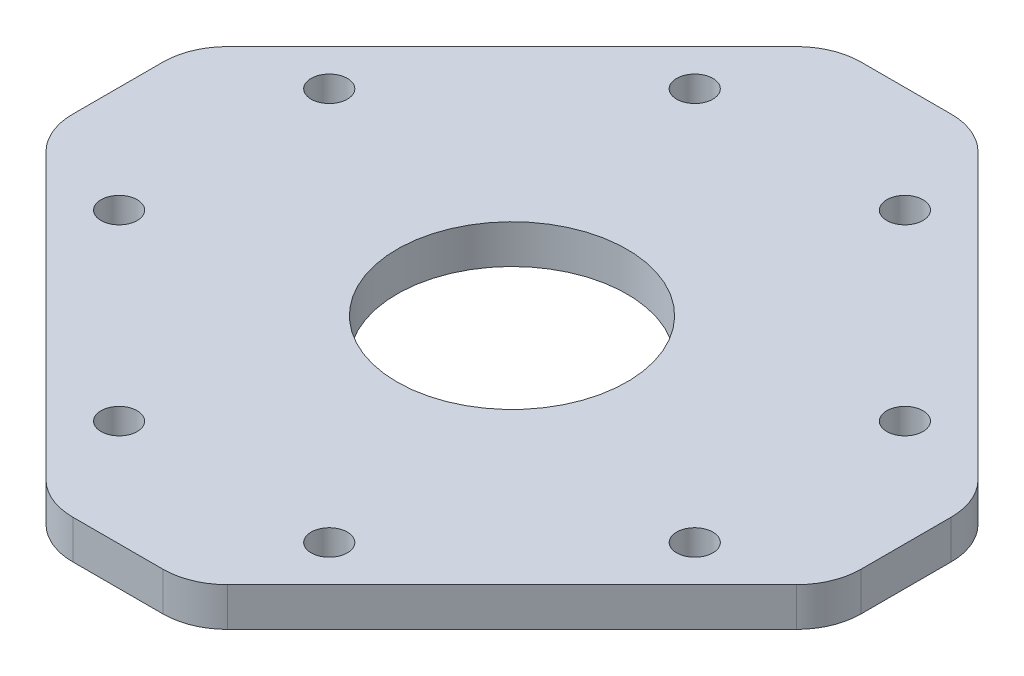
ISO-10303-21;
HEADER;
FILE_DESCRIPTION(('STEP AP214'),'2;1');
FILE_NAME('part.step','',(''),(''),'','','');
FILE_SCHEMA(('AUTOMOTIVE_DESIGN { 1 0 10303 214 1 1 1 1 }'));
ENDSEC;
DATA;
#1=APPLICATION_CONTEXT('core data for automotive mechanical design processes');
#2=APPLICATION_PROTOCOL_DEFINITION('international standard','automotive_design',2000,#1);
#3=PRODUCT_CONTEXT('',#1,'mechanical');
#4=PRODUCT('Part','Part','',(#3));
#5=PRODUCT_RELATED_PRODUCT_CATEGORY('part','',(#4));
#6=PRODUCT_DEFINITION_FORMATION('','',#4);
#7=PRODUCT_DEFINITION_CONTEXT('part definition',#1,'design');
#8=PRODUCT_DEFINITION('design','',#6,#7);
#9=PRODUCT_DEFINITION_SHAPE('','',#8);
#10=(LENGTH_UNIT() NAMED_UNIT(*) SI_UNIT(.MILLI.,.METRE.));
#11=(NAMED_UNIT(*) PLANE_ANGLE_UNIT() SI_UNIT($,.RADIAN.));
#12=(NAMED_UNIT(*) SI_UNIT($,.STERADIAN.) SOLID_ANGLE_UNIT());
#13=UNCERTAINTY_MEASURE_WITH_UNIT(LENGTH_MEASURE(1.E-05),#10,'distance_accuracy_value','');
#14=(GEOMETRIC_REPRESENTATION_CONTEXT(3) GLOBAL_UNCERTAINTY_ASSIGNED_CONTEXT((#13)) GLOBAL_UNIT_ASSIGNED_CONTEXT((#10,
#11,#12)) REPRESENTATION_CONTEXT('',''));
#15=CARTESIAN_POINT('',(0.,0.,0.));
#16=DIRECTION('',(0.,0.,1.));
#17=DIRECTION('',(1.,0.,0.));
#18=AXIS2_PLACEMENT_3D('',#15,#16,#17);
#19=CARTESIAN_POINT('',(3.49137802864851,3.,-25.5));
#20=DIRECTION('',(0.,1.,0.));
#21=DIRECTION('',(0.,0.,1.));
#22=AXIS2_PLACEMENT_3D('',#19,#20,#21);
#23=PLANE('',#22);
#24=CARTESIAN_POINT('',(-8.1317279836453,3.,-22.2738636073762));
#25=DIRECTION('',(0.,1.,0.));
#26=DIRECTION('',(0.,0.,1.));
#27=AXIS2_PLACEMENT_3D('',#24,#25,#26);
#28=CIRCLE('',#27,1.4);
#29=CARTESIAN_POINT('',(-8.1317279836453,3.,-20.8738636073762));
#30=VERTEX_POINT('',#29);
#31=EDGE_CURVE('E371',#30,#30,#28,.T.);
#32=ORIENTED_EDGE('',*,*,#31,.F.);
#33=EDGE_LOOP('',(#32));
#34=FACE_BOUND('',#33,.T.);
#35=CARTESIAN_POINT('',(22.2738636073762,3.,-8.1317279836453));
#36=DIRECTION('',(0.,1.,0.));
#37=DIRECTION('',(0.,0.,1.));
#38=AXIS2_PLACEMENT_3D('',#35,#36,#37);
#39=CIRCLE('',#38,1.4);
#40=CARTESIAN_POINT('',(22.2738636073762,3.,-6.7317279836453));
#41=VERTEX_POINT('',#40);
#42=EDGE_CURVE('E355',#41,#41,#39,.T.);
#43=ORIENTED_EDGE('',*,*,#42,.F.);
#44=EDGE_LOOP('',(#43));
#45=FACE_BOUND('',#44,.T.);
#46=CARTESIAN_POINT('',(-22.2738636073762,3.,8.1317279836453));
#47=DIRECTION('',(0.,1.,0.));
#48=DIRECTION('',(0.,0.,1.));
#49=AXIS2_PLACEMENT_3D('',#46,#47,#48);
#50=CIRCLE('',#49,1.4);
#51=CARTESIAN_POINT('',(-22.2738636073762,3.,9.5317279836453));
#52=VERTEX_POINT('',#51);
#53=EDGE_CURVE('E339',#52,#52,#50,.T.);
#54=ORIENTED_EDGE('',*,*,#53,.F.);
#55=EDGE_LOOP('',(#54));
#56=FACE_BOUND('',#55,.T.);
#57=CARTESIAN_POINT('',(8.13172798364529,3.,22.2738636073762));
#58=DIRECTION('',(0.,1.,0.));
#59=DIRECTION('',(0.,0.,1.));
#60=AXIS2_PLACEMENT_3D('',#57,#58,#59);
#61=CIRCLE('',#60,1.4);
#62=CARTESIAN_POINT('',(8.13172798364529,3.,23.6738636073762));
#63=VERTEX_POINT('',#62);
#64=EDGE_CURVE('E221',#63,#63,#61,.T.);
#65=ORIENTED_EDGE('',*,*,#64,.F.);
#66=EDGE_LOOP('',(#65));
#67=FACE_BOUND('',#66,.T.);
#68=CARTESIAN_POINT('',(3.49137802864851,3.,-25.5));
#69=DIRECTION('',(0.,1.,0.));
#70=DIRECTION('',(0.,0.,1.));
#71=AXIS2_PLACEMENT_3D('',#68,#69,#70);
#72=CIRCLE('',#71,4.99999999999999);
#73=CARTESIAN_POINT('',(7.02691193458125,3.,-29.0355339059327));
#74=VERTEX_POINT('',#73);
#75=CARTESIAN_POINT('',(3.49137802864851,3.,-30.5));
#76=VERTEX_POINT('',#75);
#77=EDGE_CURVE('E222',#74,#76,#72,.T.);
#78=ORIENTED_EDGE('',*,*,#77,.T.);
#79=DIRECTION('',(-1.,0.,0.));
#80=VECTOR('',#79,1.);
#81=CARTESIAN_POINT('',(3.49137802864851,3.,-30.5));
#82=LINE('',#81,#80);
#83=CARTESIAN_POINT('',(-3.4913780286485,3.,-30.5));
#84=VERTEX_POINT('',#83);
#85=EDGE_CURVE('E131',#76,#84,#82,.T.);
#86=ORIENTED_EDGE('',*,*,#85,.T.);
#87=CARTESIAN_POINT('',(-3.4913780286485,3.,-25.5));
#88=DIRECTION('',(0.,1.,0.));
#89=DIRECTION('',(0.,0.,1.));
#90=AXIS2_PLACEMENT_3D('',#87,#88,#89);
#91=CIRCLE('',#90,4.99999999999999);
#92=CARTESIAN_POINT('',(-7.02691193458124,3.,-29.0355339059327));
#93=VERTEX_POINT('',#92);
#94=EDGE_CURVE('E236',#84,#93,#91,.T.);
#95=ORIENTED_EDGE('',*,*,#94,.T.);
#96=DIRECTION('',(-0.707106781186547,0.,0.707106781186548));
#97=VECTOR('',#96,1.);
#98=CARTESIAN_POINT('',(-7.02691193458124,3.,-29.0355339059327));
#99=LINE('',#98,#97);
#100=CARTESIAN_POINT('',(-29.0355339059327,3.,-7.02691193458124));
#101=VERTEX_POINT('',#100);
#102=EDGE_CURVE('E239',#93,#101,#99,.T.);
#103=ORIENTED_EDGE('',*,*,#102,.T.);
#104=CARTESIAN_POINT('',(-25.5,3.,-3.4913780286485));
#105=DIRECTION('',(0.,1.,0.));
#106=DIRECTION('',(0.,0.,1.));
#107=AXIS2_PLACEMENT_3D('',#104,#105,#106);
#108=CIRCLE('',#107,4.99999999999999);
#109=CARTESIAN_POINT('',(-30.5,3.,-3.4913780286485));
#110=VERTEX_POINT('',#109);
#111=EDGE_CURVE('E243',#101,#110,#108,.T.);
#112=ORIENTED_EDGE('',*,*,#111,.T.);
#113=DIRECTION('',(0.,0.,1.));
#114=VECTOR('',#113,1.);
#115=CARTESIAN_POINT('',(-30.5,3.,-3.4913780286485));
#116=LINE('',#115,#114);
#117=CARTESIAN_POINT('',(-30.5,3.,3.4913780286485));
#118=VERTEX_POINT('',#117);
#119=EDGE_CURVE('E247',#110,#118,#116,.T.);
#120=ORIENTED_EDGE('',*,*,#119,.T.);
#121=CARTESIAN_POINT('',(-25.5,3.,3.4913780286485));
#122=DIRECTION('',(0.,1.,0.));
#123=DIRECTION('',(0.,0.,1.));
#124=AXIS2_PLACEMENT_3D('',#121,#122,#123);
#125=CIRCLE('',#124,4.99999999999999);
#126=CARTESIAN_POINT('',(-29.0355339059327,3.,7.02691193458123));
#127=VERTEX_POINT('',#126);
#128=EDGE_CURVE('E255',#118,#127,#125,.T.);
#129=ORIENTED_EDGE('',*,*,#128,.T.);
#130=DIRECTION('',(0.707106781186547,0.,0.707106781186548));
#131=VECTOR('',#130,1.);
#132=CARTESIAN_POINT('',(-29.0355339059327,3.,7.02691193458123));
#133=LINE('',#132,#131);
#134=CARTESIAN_POINT('',(-7.02691193458126,3.,29.0355339059327));
#135=VERTEX_POINT('',#134);
#136=EDGE_CURVE('E258',#127,#135,#133,.T.);
#137=ORIENTED_EDGE('',*,*,#136,.T.);
#138=CARTESIAN_POINT('',(-3.49137802864851,3.,25.5));
#139=DIRECTION('',(0.,1.,0.));
#140=DIRECTION('',(0.,0.,1.));
#141=AXIS2_PLACEMENT_3D('',#138,#139,#140);
#142=CIRCLE('',#141,4.99999999999999);
#143=CARTESIAN_POINT('',(-3.49137802864849,3.,30.5));
#144=VERTEX_POINT('',#143);
#145=EDGE_CURVE('E262',#135,#144,#142,.T.);
#146=ORIENTED_EDGE('',*,*,#145,.T.);
#147=DIRECTION('',(1.,0.,0.));
#148=VECTOR('',#147,1.);
#149=CARTESIAN_POINT('',(-3.49137802864849,3.,30.5));
#150=LINE('',#149,#148);
#151=CARTESIAN_POINT('',(3.49137802864853,3.,30.5));
#152=VERTEX_POINT('',#151);
#153=EDGE_CURVE('E266',#144,#152,#150,.T.);
#154=ORIENTED_EDGE('',*,*,#153,.T.);
#155=CARTESIAN_POINT('',(3.49137802864851,3.,25.5));
#156=DIRECTION('',(0.,1.,0.));
#157=DIRECTION('',(0.,0.,1.));
#158=AXIS2_PLACEMENT_3D('',#155,#156,#157);
#159=CIRCLE('',#158,4.99999999999999);
#160=CARTESIAN_POINT('',(7.02691193458125,3.,29.0355339059327));
#161=VERTEX_POINT('',#160);
#162=EDGE_CURVE('E273',#152,#161,#159,.T.);
#163=ORIENTED_EDGE('',*,*,#162,.T.);
#164=DIRECTION('',(0.707106781186547,0.,-0.707106781186548));
#165=VECTOR('',#164,1.);
#166=CARTESIAN_POINT('',(7.02691193458125,3.,29.0355339059327));
#167=LINE('',#166,#165);
#168=CARTESIAN_POINT('',(29.0355339059327,3.,7.02691193458124));
#169=VERTEX_POINT('',#168);
#170=EDGE_CURVE('E276',#161,#169,#167,.T.);
#171=ORIENTED_EDGE('',*,*,#170,.T.);
#172=CARTESIAN_POINT('',(25.5,3.,3.4913780286485));
#173=DIRECTION('',(0.,1.,0.));
#174=DIRECTION('',(0.,0.,1.));
#175=AXIS2_PLACEMENT_3D('',#172,#173,#174);
#176=CIRCLE('',#175,4.99999999999999);
#177=CARTESIAN_POINT('',(30.5,3.,3.4913780286485));
#178=VERTEX_POINT('',#177);
#179=EDGE_CURVE('E174',#169,#178,#176,.T.);
#180=ORIENTED_EDGE('',*,*,#179,.T.);
#181=DIRECTION('',(0.,0.,-1.));
#182=VECTOR('',#181,1.);
#183=CARTESIAN_POINT('',(30.5,3.,3.4913780286485));
#184=LINE('',#183,#182);
#185=CARTESIAN_POINT('',(30.5,3.,-3.49137802864851));
#186=VERTEX_POINT('',#185);
#187=EDGE_CURVE('E168',#178,#186,#184,.T.);
#188=ORIENTED_EDGE('',*,*,#187,.T.);
#189=CARTESIAN_POINT('',(25.5,3.,-3.49137802864851));
#190=DIRECTION('',(0.,1.,0.));
#191=DIRECTION('',(0.,0.,1.));
#192=AXIS2_PLACEMENT_3D('',#189,#190,#191);
#193=CIRCLE('',#192,4.99999999999999);
#194=CARTESIAN_POINT('',(29.0355339059327,3.,-7.02691193458125));
#195=VERTEX_POINT('',#194);
#196=EDGE_CURVE('E172',#186,#195,#193,.T.);
#197=ORIENTED_EDGE('',*,*,#196,.T.);
#198=DIRECTION('',(-0.707106781186547,0.,-0.707106781186547));
#199=VECTOR('',#198,1.);
#200=CARTESIAN_POINT('',(29.0355339059327,3.,-7.02691193458125));
#201=LINE('',#200,#199);
#202=EDGE_CURVE('E64',#195,#74,#201,.T.);
#203=ORIENTED_EDGE('',*,*,#202,.T.);
#204=EDGE_LOOP('',(#78,#86,#95,#103,#112,#120,#129,#137,#146,#154,#163,#171,#180,#188,#197,#203));
#205=FACE_BOUND('',#204,.T.);
#206=CARTESIAN_POINT('',(0.,3.,0.));
#207=DIRECTION('',(0.,1.,0.));
#208=DIRECTION('',(0.,0.,1.));
#209=AXIS2_PLACEMENT_3D('',#206,#207,#208);
#210=CIRCLE('',#209,8.9);
#211=CARTESIAN_POINT('',(0.,3.,8.9));
#212=VERTEX_POINT('',#211);
#213=EDGE_CURVE('E208',#212,#212,#210,.T.);
#214=ORIENTED_EDGE('',*,*,#213,.F.);
#215=EDGE_LOOP('',(#214));
#216=FACE_BOUND('',#215,.T.);
#217=CARTESIAN_POINT('',(-8.1317279836453,3.,22.2738636073763));
#218=DIRECTION('',(0.,1.,0.));
#219=DIRECTION('',(0.,0.,1.));
#220=AXIS2_PLACEMENT_3D('',#217,#218,#219);
#221=CIRCLE('',#220,1.4);
#222=CARTESIAN_POINT('',(-8.1317279836453,3.,23.6738636073763));
#223=VERTEX_POINT('',#222);
#224=EDGE_CURVE('E333',#223,#223,#221,.T.);
#225=ORIENTED_EDGE('',*,*,#224,.F.);
#226=EDGE_LOOP('',(#225));
#227=FACE_BOUND('',#226,.T.);
#228=CARTESIAN_POINT('',(22.2738636073762,3.,8.1317279836453));
#229=DIRECTION('',(0.,1.,0.));
#230=DIRECTION('',(0.,0.,1.));
#231=AXIS2_PLACEMENT_3D('',#228,#229,#230);
#232=CIRCLE('',#231,1.4);
#233=CARTESIAN_POINT('',(22.2738636073762,3.,9.5317279836453));
#234=VERTEX_POINT('',#233);
#235=EDGE_CURVE('E347',#234,#234,#232,.T.);
#236=ORIENTED_EDGE('',*,*,#235,.F.);
#237=EDGE_LOOP('',(#236));
#238=FACE_BOUND('',#237,.T.);
#239=CARTESIAN_POINT('',(8.1317279836453,3.,-22.2738636073762));
#240=DIRECTION('',(0.,1.,0.));
#241=DIRECTION('',(0.,0.,1.));
#242=AXIS2_PLACEMENT_3D('',#239,#240,#241);
#243=CIRCLE('',#242,1.4);
#244=CARTESIAN_POINT('',(8.1317279836453,3.,-20.8738636073762));
#245=VERTEX_POINT('',#244);
#246=EDGE_CURVE('E363',#245,#245,#243,.T.);
#247=ORIENTED_EDGE('',*,*,#246,.F.);
#248=EDGE_LOOP('',(#247));
#249=FACE_BOUND('',#248,.T.);
#250=CARTESIAN_POINT('',(-22.2738636073763,3.,-8.13172798364529));
#251=DIRECTION('',(0.,1.,0.));
#252=DIRECTION('',(0.,0.,1.));
#253=AXIS2_PLACEMENT_3D('',#250,#251,#252);
#254=CIRCLE('',#253,1.4);
#255=CARTESIAN_POINT('',(-22.2738636073763,3.,-6.73172798364529));
#256=VERTEX_POINT('',#255);
#257=EDGE_CURVE('E379',#256,#256,#254,.T.);
#258=ORIENTED_EDGE('',*,*,#257,.F.);
#259=EDGE_LOOP('',(#258));
#260=FACE_BOUND('',#259,.T.);
#261=ADVANCED_FACE('F46',(#34,#45,#56,#67,#205,#216,#227,#238,#249,#260),#23,.T.);
#262=CARTESIAN_POINT('',(3.49137802864851,0.,-25.5));
#263=DIRECTION('',(0.,1.,0.));
#264=DIRECTION('',(0.,0.,1.));
#265=AXIS2_PLACEMENT_3D('',#262,#263,#264);
#266=PLANE('',#265);
#267=CARTESIAN_POINT('',(3.49137802864851,0.,-25.5));
#268=DIRECTION('',(0.,1.,0.));
#269=DIRECTION('',(0.,0.,1.));
#270=AXIS2_PLACEMENT_3D('',#267,#268,#269);
#271=CIRCLE('',#270,4.99999999999999);
#272=CARTESIAN_POINT('',(7.02691193458125,0.,-29.0355339059327));
#273=VERTEX_POINT('',#272);
#274=CARTESIAN_POINT('',(3.49137802864851,0.,-30.5));
#275=VERTEX_POINT('',#274);
#276=EDGE_CURVE('E214',#273,#275,#271,.T.);
#277=ORIENTED_EDGE('',*,*,#276,.F.);
#278=DIRECTION('',(-0.707106781186547,0.,-0.707106781186547));
#279=VECTOR('',#278,1.);
#280=CARTESIAN_POINT('',(29.0355339059327,0.,-7.02691193458125));
#281=LINE('',#280,#279);
#282=CARTESIAN_POINT('',(29.0355339059327,0.,-7.02691193458125));
#283=VERTEX_POINT('',#282);
#284=EDGE_CURVE('E123',#283,#273,#281,.T.);
#285=ORIENTED_EDGE('',*,*,#284,.F.);
#286=CARTESIAN_POINT('',(25.5,0.,-3.49137802864851));
#287=DIRECTION('',(0.,1.,0.));
#288=DIRECTION('',(0.,0.,1.));
#289=AXIS2_PLACEMENT_3D('',#286,#287,#288);
#290=CIRCLE('',#289,4.99999999999999);
#291=CARTESIAN_POINT('',(30.5,0.,-3.49137802864851));
#292=VERTEX_POINT('',#291);
#293=EDGE_CURVE('E117',#292,#283,#290,.T.);
#294=ORIENTED_EDGE('',*,*,#293,.F.);
#295=DIRECTION('',(0.,0.,-1.));
#296=VECTOR('',#295,1.);
#297=CARTESIAN_POINT('',(30.5,0.,3.4913780286485));
#298=LINE('',#297,#296);
#299=CARTESIAN_POINT('',(30.5,0.,3.4913780286485));
#300=VERTEX_POINT('',#299);
#301=EDGE_CURVE('E183',#300,#292,#298,.T.);
#302=ORIENTED_EDGE('',*,*,#301,.F.);
#303=CARTESIAN_POINT('',(25.5,0.,3.4913780286485));
#304=DIRECTION('',(0.,1.,0.));
#305=DIRECTION('',(0.,0.,1.));
#306=AXIS2_PLACEMENT_3D('',#303,#304,#305);
#307=CIRCLE('',#306,4.99999999999999);
#308=CARTESIAN_POINT('',(29.0355339059327,0.,7.02691193458124));
#309=VERTEX_POINT('',#308);
#310=EDGE_CURVE('E290',#309,#300,#307,.T.);
#311=ORIENTED_EDGE('',*,*,#310,.F.);
#312=DIRECTION('',(0.707106781186547,0.,-0.707106781186548));
#313=VECTOR('',#312,1.);
#314=CARTESIAN_POINT('',(7.02691193458125,0.,29.0355339059327));
#315=LINE('',#314,#313);
#316=CARTESIAN_POINT('',(7.02691193458125,0.,29.0355339059327));
#317=VERTEX_POINT('',#316);
#318=EDGE_CURVE('E293',#317,#309,#315,.T.);
#319=ORIENTED_EDGE('',*,*,#318,.F.);
#320=CARTESIAN_POINT('',(3.49137802864851,0.,25.5));
#321=DIRECTION('',(0.,1.,0.));
#322=DIRECTION('',(0.,0.,1.));
#323=AXIS2_PLACEMENT_3D('',#320,#321,#322);
#324=CIRCLE('',#323,4.99999999999999);
#325=CARTESIAN_POINT('',(3.49137802864853,0.,30.5));
#326=VERTEX_POINT('',#325);
#327=EDGE_CURVE('E296',#326,#317,#324,.T.);
#328=ORIENTED_EDGE('',*,*,#327,.F.);
#329=DIRECTION('',(1.,0.,0.));
#330=VECTOR('',#329,1.);
#331=CARTESIAN_POINT('',(-3.49137802864849,0.,30.5));
#332=LINE('',#331,#330);
#333=CARTESIAN_POINT('',(-3.49137802864849,0.,30.5));
#334=VERTEX_POINT('',#333);
#335=EDGE_CURVE('E299',#334,#326,#332,.T.);
#336=ORIENTED_EDGE('',*,*,#335,.F.);
#337=CARTESIAN_POINT('',(-3.49137802864851,0.,25.5));
#338=DIRECTION('',(0.,1.,0.));
#339=DIRECTION('',(0.,0.,1.));
#340=AXIS2_PLACEMENT_3D('',#337,#338,#339);
#341=CIRCLE('',#340,4.99999999999999);
#342=CARTESIAN_POINT('',(-7.02691193458126,0.,29.0355339059327));
#343=VERTEX_POINT('',#342);
#344=EDGE_CURVE('E302',#343,#334,#341,.T.);
#345=ORIENTED_EDGE('',*,*,#344,.F.);
#346=DIRECTION('',(0.707106781186547,0.,0.707106781186548));
#347=VECTOR('',#346,1.);
#348=CARTESIAN_POINT('',(-29.0355339059327,0.,7.02691193458123));
#349=LINE('',#348,#347);
#350=CARTESIAN_POINT('',(-29.0355339059327,0.,7.02691193458123));
#351=VERTEX_POINT('',#350);
#352=EDGE_CURVE('E305',#351,#343,#349,.T.);
#353=ORIENTED_EDGE('',*,*,#352,.F.);
#354=CARTESIAN_POINT('',(-25.5,0.,3.4913780286485));
#355=DIRECTION('',(0.,1.,0.));
#356=DIRECTION('',(0.,0.,1.));
#357=AXIS2_PLACEMENT_3D('',#354,#355,#356);
#358=CIRCLE('',#357,4.99999999999999);
#359=CARTESIAN_POINT('',(-30.5,0.,3.4913780286485));
#360=VERTEX_POINT('',#359);
#361=EDGE_CURVE('E308',#360,#351,#358,.T.);
#362=ORIENTED_EDGE('',*,*,#361,.F.);
#363=DIRECTION('',(0.,0.,1.));
#364=VECTOR('',#363,1.);
#365=CARTESIAN_POINT('',(-30.5,0.,-3.4913780286485));
#366=LINE('',#365,#364);
#367=CARTESIAN_POINT('',(-30.5,0.,-3.4913780286485));
#368=VERTEX_POINT('',#367);
#369=EDGE_CURVE('E311',#368,#360,#366,.T.);
#370=ORIENTED_EDGE('',*,*,#369,.F.);
#371=CARTESIAN_POINT('',(-25.5,0.,-3.4913780286485));
#372=DIRECTION('',(0.,1.,0.));
#373=DIRECTION('',(0.,0.,1.));
#374=AXIS2_PLACEMENT_3D('',#371,#372,#373);
#375=CIRCLE('',#374,4.99999999999999);
#376=CARTESIAN_POINT('',(-29.0355339059327,0.,-7.02691193458124));
#377=VERTEX_POINT('',#376);
#378=EDGE_CURVE('E314',#377,#368,#375,.T.);
#379=ORIENTED_EDGE('',*,*,#378,.F.);
#380=DIRECTION('',(-0.707106781186547,0.,0.707106781186548));
#381=VECTOR('',#380,1.);
#382=CARTESIAN_POINT('',(-7.02691193458124,0.,-29.0355339059327));
#383=LINE('',#382,#381);
#384=CARTESIAN_POINT('',(-7.02691193458124,0.,-29.0355339059327));
#385=VERTEX_POINT('',#384);
#386=EDGE_CURVE('E317',#385,#377,#383,.T.);
#387=ORIENTED_EDGE('',*,*,#386,.F.);
#388=CARTESIAN_POINT('',(-3.4913780286485,0.,-25.5));
#389=DIRECTION('',(0.,1.,0.));
#390=DIRECTION('',(0.,0.,1.));
#391=AXIS2_PLACEMENT_3D('',#388,#389,#390);
#392=CIRCLE('',#391,4.99999999999999);
#393=CARTESIAN_POINT('',(-3.4913780286485,0.,-30.5));
#394=VERTEX_POINT('',#393);
#395=EDGE_CURVE('E320',#394,#385,#392,.T.);
#396=ORIENTED_EDGE('',*,*,#395,.F.);
#397=DIRECTION('',(-1.,0.,0.));
#398=VECTOR('',#397,1.);
#399=CARTESIAN_POINT('',(3.49137802864851,0.,-30.5));
#400=LINE('',#399,#398);
#401=EDGE_CURVE('E323',#275,#394,#400,.T.);
#402=ORIENTED_EDGE('',*,*,#401,.F.);
#403=EDGE_LOOP('',(#277,#285,#294,#302,#311,#319,#328,#336,#345,#353,#362,#370,#379,#387,#396,#402));
#404=FACE_BOUND('',#403,.T.);
#405=CARTESIAN_POINT('',(0.,0.,0.));
#406=DIRECTION('',(0.,1.,0.));
#407=DIRECTION('',(0.,0.,1.));
#408=AXIS2_PLACEMENT_3D('',#405,#406,#407);
#409=CIRCLE('',#408,8.9);
#410=CARTESIAN_POINT('',(0.,0.,8.9));
#411=VERTEX_POINT('',#410);
#412=EDGE_CURVE('E215',#411,#411,#409,.T.);
#413=ORIENTED_EDGE('',*,*,#412,.T.);
#414=EDGE_LOOP('',(#413));
#415=FACE_BOUND('',#414,.T.);
#416=CARTESIAN_POINT('',(8.13172798364529,0.,22.2738636073762));
#417=DIRECTION('',(0.,1.,0.));
#418=DIRECTION('',(0.,0.,1.));
#419=AXIS2_PLACEMENT_3D('',#416,#417,#418);
#420=CIRCLE('',#419,1.4);
#421=CARTESIAN_POINT('',(8.13172798364529,0.,23.6738636073762));
#422=VERTEX_POINT('',#421);
#423=EDGE_CURVE('E216',#422,#422,#420,.T.);
#424=ORIENTED_EDGE('',*,*,#423,.T.);
#425=EDGE_LOOP('',(#424));
#426=FACE_BOUND('',#425,.T.);
#427=CARTESIAN_POINT('',(-8.1317279836453,0.,22.2738636073763));
#428=DIRECTION('',(0.,1.,0.));
#429=DIRECTION('',(0.,0.,1.));
#430=AXIS2_PLACEMENT_3D('',#427,#428,#429);
#431=CIRCLE('',#430,1.4);
#432=CARTESIAN_POINT('',(-8.1317279836453,0.,23.6738636073763));
#433=VERTEX_POINT('',#432);
#434=EDGE_CURVE('E336',#433,#433,#431,.T.);
#435=ORIENTED_EDGE('',*,*,#434,.T.);
#436=EDGE_LOOP('',(#435));
#437=FACE_BOUND('',#436,.T.);
#438=CARTESIAN_POINT('',(-22.2738636073762,0.,8.1317279836453));
#439=DIRECTION('',(0.,1.,0.));
#440=DIRECTION('',(0.,0.,1.));
#441=AXIS2_PLACEMENT_3D('',#438,#439,#440);
#442=CIRCLE('',#441,1.4);
#443=CARTESIAN_POINT('',(-22.2738636073762,0.,9.5317279836453));
#444=VERTEX_POINT('',#443);
#445=EDGE_CURVE('E343',#444,#444,#442,.T.);
#446=ORIENTED_EDGE('',*,*,#445,.T.);
#447=EDGE_LOOP('',(#446));
#448=FACE_BOUND('',#447,.T.);
#449=CARTESIAN_POINT('',(22.2738636073762,0.,8.1317279836453));
#450=DIRECTION('',(0.,1.,0.));
#451=DIRECTION('',(0.,0.,1.));
#452=AXIS2_PLACEMENT_3D('',#449,#450,#451);
#453=CIRCLE('',#452,1.4);
#454=CARTESIAN_POINT('',(22.2738636073762,0.,9.5317279836453));
#455=VERTEX_POINT('',#454);
#456=EDGE_CURVE('E351',#455,#455,#453,.T.);
#457=ORIENTED_EDGE('',*,*,#456,.T.);
#458=EDGE_LOOP('',(#457));
#459=FACE_BOUND('',#458,.T.);
#460=CARTESIAN_POINT('',(22.2738636073762,0.,-8.1317279836453));
#461=DIRECTION('',(0.,1.,0.));
#462=DIRECTION('',(0.,0.,1.));
#463=AXIS2_PLACEMENT_3D('',#460,#461,#462);
#464=CIRCLE('',#463,1.4);
#465=CARTESIAN_POINT('',(22.2738636073762,0.,-6.7317279836453));
#466=VERTEX_POINT('',#465);
#467=EDGE_CURVE('E359',#466,#466,#464,.T.);
#468=ORIENTED_EDGE('',*,*,#467,.T.);
#469=EDGE_LOOP('',(#468));
#470=FACE_BOUND('',#469,.T.);
#471=CARTESIAN_POINT('',(8.1317279836453,0.,-22.2738636073762));
#472=DIRECTION('',(0.,1.,0.));
#473=DIRECTION('',(0.,0.,1.));
#474=AXIS2_PLACEMENT_3D('',#471,#472,#473);
#475=CIRCLE('',#474,1.4);
#476=CARTESIAN_POINT('',(8.1317279836453,0.,-20.8738636073762));
#477=VERTEX_POINT('',#476);
#478=EDGE_CURVE('E367',#477,#477,#475,.T.);
#479=ORIENTED_EDGE('',*,*,#478,.T.);
#480=EDGE_LOOP('',(#479));
#481=FACE_BOUND('',#480,.T.);
#482=CARTESIAN_POINT('',(-8.1317279836453,0.,-22.2738636073762));
#483=DIRECTION('',(0.,1.,0.));
#484=DIRECTION('',(0.,0.,1.));
#485=AXIS2_PLACEMENT_3D('',#482,#483,#484);
#486=CIRCLE('',#485,1.4);
#487=CARTESIAN_POINT('',(-8.1317279836453,0.,-20.8738636073762));
#488=VERTEX_POINT('',#487);
#489=EDGE_CURVE('E375',#488,#488,#486,.T.);
#490=ORIENTED_EDGE('',*,*,#489,.T.);
#491=EDGE_LOOP('',(#490));
#492=FACE_BOUND('',#491,.T.);
#493=CARTESIAN_POINT('',(-22.2738636073763,0.,-8.13172798364529));
#494=DIRECTION('',(0.,1.,0.));
#495=DIRECTION('',(0.,0.,1.));
#496=AXIS2_PLACEMENT_3D('',#493,#494,#495);
#497=CIRCLE('',#496,1.4);
#498=CARTESIAN_POINT('',(-22.2738636073763,0.,-6.73172798364529));
#499=VERTEX_POINT('',#498);
#500=EDGE_CURVE('E383',#499,#499,#497,.T.);
#501=ORIENTED_EDGE('',*,*,#500,.T.);
#502=EDGE_LOOP('',(#501));
#503=FACE_BOUND('',#502,.T.);
#504=ADVANCED_FACE('F398',(#404,#415,#426,#437,#448,#459,#470,#481,#492,#503),#266,.F.);
#505=CARTESIAN_POINT('',(3.49137802864851,3.,-25.5));
#506=DIRECTION('',(0.,-1.,0.));
#507=DIRECTION('',(0.,0.,-1.));
#508=AXIS2_PLACEMENT_3D('',#505,#506,#507);
#509=CYLINDRICAL_SURFACE('',#508,4.99999999999999);
#510=ORIENTED_EDGE('',*,*,#276,.T.);
#511=DIRECTION('',(0.,-1.,0.));
#512=VECTOR('',#511,1.);
#513=CARTESIAN_POINT('',(3.49137802864851,3.,-30.5));
#514=LINE('',#513,#512);
#515=EDGE_CURVE('E12',#76,#275,#514,.T.);
#516=ORIENTED_EDGE('',*,*,#515,.F.);
#517=ORIENTED_EDGE('',*,*,#77,.F.);
#518=DIRECTION('',(0.,-1.,0.));
#519=VECTOR('',#518,1.);
#520=CARTESIAN_POINT('',(7.02691193458125,3.,-29.0355339059327));
#521=LINE('',#520,#519);
#522=EDGE_CURVE('E192',#74,#273,#521,.T.);
#523=ORIENTED_EDGE('',*,*,#522,.T.);
#524=EDGE_LOOP('',(#510,#516,#517,#523));
#525=FACE_BOUND('',#524,.T.);
#526=ADVANCED_FACE('F48',(#525),#509,.T.);
#527=CARTESIAN_POINT('',(3.49137802864851,3.,-30.5));
#528=DIRECTION('',(0.,0.,1.));
#529=DIRECTION('',(1.,0.,0.));
#530=AXIS2_PLACEMENT_3D('',#527,#528,#529);
#531=PLANE('',#530);
#532=ORIENTED_EDGE('',*,*,#401,.T.);
#533=DIRECTION('',(0.,-1.,0.));
#534=VECTOR('',#533,1.);
#535=CARTESIAN_POINT('',(-3.4913780286485,3.,-30.5));
#536=LINE('',#535,#534);
#537=EDGE_CURVE('E56',#84,#394,#536,.T.);
#538=ORIENTED_EDGE('',*,*,#537,.F.);
#539=ORIENTED_EDGE('',*,*,#85,.F.);
#540=ORIENTED_EDGE('',*,*,#515,.T.);
#541=EDGE_LOOP('',(#532,#538,#539,#540));
#542=FACE_BOUND('',#541,.T.);
#543=ADVANCED_FACE('F474',(#542),#531,.F.);
#544=CARTESIAN_POINT('',(-3.4913780286485,3.,-25.5));
#545=DIRECTION('',(0.,-1.,0.));
#546=DIRECTION('',(0.,0.,-1.));
#547=AXIS2_PLACEMENT_3D('',#544,#545,#546);
#548=CYLINDRICAL_SURFACE('',#547,4.99999999999999);
#549=ORIENTED_EDGE('',*,*,#395,.T.);
#550=DIRECTION('',(0.,-1.,0.));
#551=VECTOR('',#550,1.);
#552=CARTESIAN_POINT('',(-7.02691193458124,3.,-29.0355339059327));
#553=LINE('',#552,#551);
#554=EDGE_CURVE('E489',#93,#385,#553,.T.);
#555=ORIENTED_EDGE('',*,*,#554,.F.);
#556=ORIENTED_EDGE('',*,*,#94,.F.);
#557=ORIENTED_EDGE('',*,*,#537,.T.);
#558=EDGE_LOOP('',(#549,#555,#556,#557));
#559=FACE_BOUND('',#558,.T.);
#560=ADVANCED_FACE('F471',(#559),#548,.T.);
#561=CARTESIAN_POINT('',(-7.02691193458124,3.,-29.0355339059327));
#562=DIRECTION('',(0.707106781186548,0.,0.707106781186547));
#563=DIRECTION('',(0.707106781186547,0.,-0.707106781186548));
#564=AXIS2_PLACEMENT_3D('',#561,#562,#563);
#565=PLANE('',#564);
#566=ORIENTED_EDGE('',*,*,#386,.T.);
#567=DIRECTION('',(0.,-1.,0.));
#568=VECTOR('',#567,1.);
#569=CARTESIAN_POINT('',(-29.0355339059327,3.,-7.02691193458124));
#570=LINE('',#569,#568);
#571=EDGE_CURVE('E497',#101,#377,#570,.T.);
#572=ORIENTED_EDGE('',*,*,#571,.F.);
#573=ORIENTED_EDGE('',*,*,#102,.F.);
#574=ORIENTED_EDGE('',*,*,#554,.T.);
#575=EDGE_LOOP('',(#566,#572,#573,#574));
#576=FACE_BOUND('',#575,.T.);
#577=ADVANCED_FACE('F467',(#576),#565,.F.);
#578=CARTESIAN_POINT('',(-25.5,3.,-3.4913780286485));
#579=DIRECTION('',(0.,-1.,0.));
#580=DIRECTION('',(0.,0.,-1.));
#581=AXIS2_PLACEMENT_3D('',#578,#579,#580);
#582=CYLINDRICAL_SURFACE('',#581,4.99999999999999);
#583=ORIENTED_EDGE('',*,*,#378,.T.);
#584=DIRECTION('',(0.,-1.,0.));
#585=VECTOR('',#584,1.);
#586=CARTESIAN_POINT('',(-30.5,3.,-3.4913780286485));
#587=LINE('',#586,#585);
#588=EDGE_CURVE('E502',#110,#368,#587,.T.);
#589=ORIENTED_EDGE('',*,*,#588,.F.);
#590=ORIENTED_EDGE('',*,*,#111,.F.);
#591=ORIENTED_EDGE('',*,*,#571,.T.);
#592=EDGE_LOOP('',(#583,#589,#590,#591));
#593=FACE_BOUND('',#592,.T.);
#594=ADVANCED_FACE('F463',(#593),#582,.T.);
#595=CARTESIAN_POINT('',(-30.5,3.,-3.4913780286485));
#596=DIRECTION('',(1.,0.,0.));
#597=DIRECTION('',(0.,0.,-1.));
#598=AXIS2_PLACEMENT_3D('',#595,#596,#597);
#599=PLANE('',#598);
#600=ORIENTED_EDGE('',*,*,#369,.T.);
#601=DIRECTION('',(0.,-1.,0.));
#602=VECTOR('',#601,1.);
#603=CARTESIAN_POINT('',(-30.5,3.,3.4913780286485));
#604=LINE('',#603,#602);
#605=EDGE_CURVE('E507',#118,#360,#604,.T.);
#606=ORIENTED_EDGE('',*,*,#605,.F.);
#607=ORIENTED_EDGE('',*,*,#119,.F.);
#608=ORIENTED_EDGE('',*,*,#588,.T.);
#609=EDGE_LOOP('',(#600,#606,#607,#608));
#610=FACE_BOUND('',#609,.T.);
#611=ADVANCED_FACE('F459',(#610),#599,.F.);
#612=CARTESIAN_POINT('',(-25.5,3.,3.4913780286485));
#613=DIRECTION('',(0.,-1.,0.));
#614=DIRECTION('',(0.,0.,-1.));
#615=AXIS2_PLACEMENT_3D('',#612,#613,#614);
#616=CYLINDRICAL_SURFACE('',#615,4.99999999999999);
#617=ORIENTED_EDGE('',*,*,#361,.T.);
#618=DIRECTION('',(0.,-1.,0.));
#619=VECTOR('',#618,1.);
#620=CARTESIAN_POINT('',(-29.0355339059327,3.,7.02691193458123));
#621=LINE('',#620,#619);
#622=EDGE_CURVE('E513',#127,#351,#621,.T.);
#623=ORIENTED_EDGE('',*,*,#622,.F.);
#624=ORIENTED_EDGE('',*,*,#128,.F.);
#625=ORIENTED_EDGE('',*,*,#605,.T.);
#626=EDGE_LOOP('',(#617,#623,#624,#625));
#627=FACE_BOUND('',#626,.T.);
#628=ADVANCED_FACE('F455',(#627),#616,.T.);
#629=CARTESIAN_POINT('',(-29.0355339059327,3.,7.02691193458123));
#630=DIRECTION('',(0.707106781186548,0.,-0.707106781186547));
#631=DIRECTION('',(-0.707106781186547,0.,-0.707106781186548));
#632=AXIS2_PLACEMENT_3D('',#629,#630,#631);
#633=PLANE('',#632);
#634=ORIENTED_EDGE('',*,*,#352,.T.);
#635=DIRECTION('',(0.,-1.,0.));
#636=VECTOR('',#635,1.);
#637=CARTESIAN_POINT('',(-7.02691193458126,3.,29.0355339059327));
#638=LINE('',#637,#636);
#639=EDGE_CURVE('E517',#135,#343,#638,.T.);
#640=ORIENTED_EDGE('',*,*,#639,.F.);
#641=ORIENTED_EDGE('',*,*,#136,.F.);
#642=ORIENTED_EDGE('',*,*,#622,.T.);
#643=EDGE_LOOP('',(#634,#640,#641,#642));
#644=FACE_BOUND('',#643,.T.);
#645=ADVANCED_FACE('F451',(#644),#633,.F.);
#646=CARTESIAN_POINT('',(-3.49137802864851,3.,25.5));
#647=DIRECTION('',(0.,-1.,0.));
#648=DIRECTION('',(0.,0.,-1.));
#649=AXIS2_PLACEMENT_3D('',#646,#647,#648);
#650=CYLINDRICAL_SURFACE('',#649,4.99999999999999);
#651=ORIENTED_EDGE('',*,*,#344,.T.);
#652=DIRECTION('',(0.,-1.,0.));
#653=VECTOR('',#652,1.);
#654=CARTESIAN_POINT('',(-3.49137802864849,3.,30.5));
#655=LINE('',#654,#653);
#656=EDGE_CURVE('E521',#144,#334,#655,.T.);
#657=ORIENTED_EDGE('',*,*,#656,.F.);
#658=ORIENTED_EDGE('',*,*,#145,.F.);
#659=ORIENTED_EDGE('',*,*,#639,.T.);
#660=EDGE_LOOP('',(#651,#657,#658,#659));
#661=FACE_BOUND('',#660,.T.);
#662=ADVANCED_FACE('F447',(#661),#650,.T.);
#663=CARTESIAN_POINT('',(-3.49137802864849,3.,30.5));
#664=DIRECTION('',(0.,0.,-1.));
#665=DIRECTION('',(-1.,0.,0.));
#666=AXIS2_PLACEMENT_3D('',#663,#664,#665);
#667=PLANE('',#666);
#668=ORIENTED_EDGE('',*,*,#335,.T.);
#669=DIRECTION('',(0.,-1.,0.));
#670=VECTOR('',#669,1.);
#671=CARTESIAN_POINT('',(3.49137802864853,3.,30.5));
#672=LINE('',#671,#670);
#673=EDGE_CURVE('E525',#152,#326,#672,.T.);
#674=ORIENTED_EDGE('',*,*,#673,.F.);
#675=ORIENTED_EDGE('',*,*,#153,.F.);
#676=ORIENTED_EDGE('',*,*,#656,.T.);
#677=EDGE_LOOP('',(#668,#674,#675,#676));
#678=FACE_BOUND('',#677,.T.);
#679=ADVANCED_FACE('F443',(#678),#667,.F.);
#680=CARTESIAN_POINT('',(3.49137802864851,3.,25.5));
#681=DIRECTION('',(0.,-1.,0.));
#682=DIRECTION('',(0.,0.,-1.));
#683=AXIS2_PLACEMENT_3D('',#680,#681,#682);
#684=CYLINDRICAL_SURFACE('',#683,4.99999999999999);
#685=ORIENTED_EDGE('',*,*,#327,.T.);
#686=DIRECTION('',(0.,-1.,0.));
#687=VECTOR('',#686,1.);
#688=CARTESIAN_POINT('',(7.02691193458125,3.,29.0355339059327));
#689=LINE('',#688,#687);
#690=EDGE_CURVE('E529',#161,#317,#689,.T.);
#691=ORIENTED_EDGE('',*,*,#690,.F.);
#692=ORIENTED_EDGE('',*,*,#162,.F.);
#693=ORIENTED_EDGE('',*,*,#673,.T.);
#694=EDGE_LOOP('',(#685,#691,#692,#693));
#695=FACE_BOUND('',#694,.T.);
#696=ADVANCED_FACE('F439',(#695),#684,.T.);
#697=CARTESIAN_POINT('',(7.02691193458125,3.,29.0355339059327));
#698=DIRECTION('',(-0.707106781186548,0.,-0.707106781186547));
#699=DIRECTION('',(-0.707106781186547,0.,0.707106781186548));
#700=AXIS2_PLACEMENT_3D('',#697,#698,#699);
#701=PLANE('',#700);
#702=ORIENTED_EDGE('',*,*,#318,.T.);
#703=DIRECTION('',(0.,-1.,0.));
#704=VECTOR('',#703,1.);
#705=CARTESIAN_POINT('',(29.0355339059327,3.,7.02691193458124));
#706=LINE('',#705,#704);
#707=EDGE_CURVE('E533',#169,#309,#706,.T.);
#708=ORIENTED_EDGE('',*,*,#707,.F.);
#709=ORIENTED_EDGE('',*,*,#170,.F.);
#710=ORIENTED_EDGE('',*,*,#690,.T.);
#711=EDGE_LOOP('',(#702,#708,#709,#710));
#712=FACE_BOUND('',#711,.T.);
#713=ADVANCED_FACE('F435',(#712),#701,.F.);
#714=CARTESIAN_POINT('',(25.5,3.,3.4913780286485));
#715=DIRECTION('',(0.,-1.,0.));
#716=DIRECTION('',(0.,0.,-1.));
#717=AXIS2_PLACEMENT_3D('',#714,#715,#716);
#718=CYLINDRICAL_SURFACE('',#717,4.99999999999999);
#719=ORIENTED_EDGE('',*,*,#310,.T.);
#720=DIRECTION('',(0.,-1.,0.));
#721=VECTOR('',#720,1.);
#722=CARTESIAN_POINT('',(30.5,3.,3.4913780286485));
#723=LINE('',#722,#721);
#724=EDGE_CURVE('E185',#178,#300,#723,.T.);
#725=ORIENTED_EDGE('',*,*,#724,.F.);
#726=ORIENTED_EDGE('',*,*,#179,.F.);
#727=ORIENTED_EDGE('',*,*,#707,.T.);
#728=EDGE_LOOP('',(#719,#725,#726,#727));
#729=FACE_BOUND('',#728,.T.);
#730=ADVANCED_FACE('F432',(#729),#718,.T.);
#731=CARTESIAN_POINT('',(30.5,3.,3.4913780286485));
#732=DIRECTION('',(-1.,0.,0.));
#733=DIRECTION('',(0.,0.,1.));
#734=AXIS2_PLACEMENT_3D('',#731,#732,#733);
#735=PLANE('',#734);
#736=ORIENTED_EDGE('',*,*,#301,.T.);
#737=DIRECTION('',(0.,-1.,0.));
#738=VECTOR('',#737,1.);
#739=CARTESIAN_POINT('',(30.5,3.,-3.49137802864851));
#740=LINE('',#739,#738);
#741=EDGE_CURVE('E180',#186,#292,#740,.T.);
#742=ORIENTED_EDGE('',*,*,#741,.F.);
#743=ORIENTED_EDGE('',*,*,#187,.F.);
#744=ORIENTED_EDGE('',*,*,#724,.T.);
#745=EDGE_LOOP('',(#736,#742,#743,#744));
#746=FACE_BOUND('',#745,.T.);
#747=ADVANCED_FACE('F181',(#746),#735,.F.);
#748=CARTESIAN_POINT('',(25.5,3.,-3.49137802864851));
#749=DIRECTION('',(0.,-1.,0.));
#750=DIRECTION('',(0.,0.,-1.));
#751=AXIS2_PLACEMENT_3D('',#748,#749,#750);
#752=CYLINDRICAL_SURFACE('',#751,4.99999999999999);
#753=ORIENTED_EDGE('',*,*,#293,.T.);
#754=DIRECTION('',(0.,-1.,0.));
#755=VECTOR('',#754,1.);
#756=CARTESIAN_POINT('',(29.0355339059327,3.,-7.02691193458125));
#757=LINE('',#756,#755);
#758=EDGE_CURVE('E186',#195,#283,#757,.T.);
#759=ORIENTED_EDGE('',*,*,#758,.F.);
#760=ORIENTED_EDGE('',*,*,#196,.F.);
#761=ORIENTED_EDGE('',*,*,#741,.T.);
#762=EDGE_LOOP('',(#753,#759,#760,#761));
#763=FACE_BOUND('',#762,.T.);
#764=ADVANCED_FACE('F188',(#763),#752,.T.);
#765=CARTESIAN_POINT('',(29.0355339059327,3.,-7.02691193458125));
#766=DIRECTION('',(-0.707106781186548,0.,0.707106781186548));
#767=DIRECTION('',(0.707106781186548,0.,0.707106781186548));
#768=AXIS2_PLACEMENT_3D('',#765,#766,#767);
#769=PLANE('',#768);
#770=ORIENTED_EDGE('',*,*,#284,.T.);
#771=ORIENTED_EDGE('',*,*,#522,.F.);
#772=ORIENTED_EDGE('',*,*,#202,.F.);
#773=ORIENTED_EDGE('',*,*,#758,.T.);
#774=EDGE_LOOP('',(#770,#771,#772,#773));
#775=FACE_BOUND('',#774,.T.);
#776=ADVANCED_FACE('F425',(#775),#769,.F.);
#777=CARTESIAN_POINT('',(0.,3.,0.));
#778=DIRECTION('',(0.,-1.,0.));
#779=DIRECTION('',(0.,0.,-1.));
#780=AXIS2_PLACEMENT_3D('',#777,#778,#779);
#781=CYLINDRICAL_SURFACE('',#780,8.9);
#782=ORIENTED_EDGE('',*,*,#213,.T.);
#783=EDGE_LOOP('',(#782));
#784=FACE_BOUND('',#783,.T.);
#785=ORIENTED_EDGE('',*,*,#412,.F.);
#786=EDGE_LOOP('',(#785));
#787=FACE_BOUND('',#786,.T.);
#788=ADVANCED_FACE('F422',(#784,#787),#781,.F.);
#789=CARTESIAN_POINT('',(8.13172798364529,3.,22.2738636073762));
#790=DIRECTION('',(0.,-1.,0.));
#791=DIRECTION('',(0.,0.,-1.));
#792=AXIS2_PLACEMENT_3D('',#789,#790,#791);
#793=CYLINDRICAL_SURFACE('',#792,1.4);
#794=ORIENTED_EDGE('',*,*,#64,.T.);
#795=EDGE_LOOP('',(#794));
#796=FACE_BOUND('',#795,.T.);
#797=ORIENTED_EDGE('',*,*,#423,.F.);
#798=EDGE_LOOP('',(#797));
#799=FACE_BOUND('',#798,.T.);
#800=ADVANCED_FACE('F601',(#796,#799),#793,.F.);
#801=CARTESIAN_POINT('',(-8.1317279836453,3.,22.2738636073763));
#802=DIRECTION('',(0.,-1.,0.));
#803=DIRECTION('',(0.,0.,-1.));
#804=AXIS2_PLACEMENT_3D('',#801,#802,#803);
#805=CYLINDRICAL_SURFACE('',#804,1.4);
#806=ORIENTED_EDGE('',*,*,#224,.T.);
#807=EDGE_LOOP('',(#806));
#808=FACE_BOUND('',#807,.T.);
#809=ORIENTED_EDGE('',*,*,#434,.F.);
#810=EDGE_LOOP('',(#809));
#811=FACE_BOUND('',#810,.T.);
#812=ADVANCED_FACE('F598',(#808,#811),#805,.F.);
#813=CARTESIAN_POINT('',(-22.2738636073762,3.,8.1317279836453));
#814=DIRECTION('',(0.,-1.,0.));
#815=DIRECTION('',(0.,0.,-1.));
#816=AXIS2_PLACEMENT_3D('',#813,#814,#815);
#817=CYLINDRICAL_SURFACE('',#816,1.4);
#818=ORIENTED_EDGE('',*,*,#53,.T.);
#819=EDGE_LOOP('',(#818));
#820=FACE_BOUND('',#819,.T.);
#821=ORIENTED_EDGE('',*,*,#445,.F.);
#822=EDGE_LOOP('',(#821));
#823=FACE_BOUND('',#822,.T.);
#824=ADVANCED_FACE('F594',(#820,#823),#817,.F.);
#825=CARTESIAN_POINT('',(22.2738636073762,3.,8.1317279836453));
#826=DIRECTION('',(0.,-1.,0.));
#827=DIRECTION('',(0.,0.,-1.));
#828=AXIS2_PLACEMENT_3D('',#825,#826,#827);
#829=CYLINDRICAL_SURFACE('',#828,1.4);
#830=ORIENTED_EDGE('',*,*,#235,.T.);
#831=EDGE_LOOP('',(#830));
#832=FACE_BOUND('',#831,.T.);
#833=ORIENTED_EDGE('',*,*,#456,.F.);
#834=EDGE_LOOP('',(#833));
#835=FACE_BOUND('',#834,.T.);
#836=ADVANCED_FACE('F588',(#832,#835),#829,.F.);
#837=CARTESIAN_POINT('',(22.2738636073762,3.,-8.1317279836453));
#838=DIRECTION('',(0.,-1.,0.));
#839=DIRECTION('',(0.,0.,-1.));
#840=AXIS2_PLACEMENT_3D('',#837,#838,#839);
#841=CYLINDRICAL_SURFACE('',#840,1.4);
#842=ORIENTED_EDGE('',*,*,#42,.T.);
#843=EDGE_LOOP('',(#842));
#844=FACE_BOUND('',#843,.T.);
#845=ORIENTED_EDGE('',*,*,#467,.F.);
#846=EDGE_LOOP('',(#845));
#847=FACE_BOUND('',#846,.T.);
#848=ADVANCED_FACE('F582',(#844,#847),#841,.F.);
#849=CARTESIAN_POINT('',(8.1317279836453,3.,-22.2738636073762));
#850=DIRECTION('',(0.,-1.,0.));
#851=DIRECTION('',(0.,0.,-1.));
#852=AXIS2_PLACEMENT_3D('',#849,#850,#851);
#853=CYLINDRICAL_SURFACE('',#852,1.4);
#854=ORIENTED_EDGE('',*,*,#246,.T.);
#855=EDGE_LOOP('',(#854));
#856=FACE_BOUND('',#855,.T.);
#857=ORIENTED_EDGE('',*,*,#478,.F.);
#858=EDGE_LOOP('',(#857));
#859=FACE_BOUND('',#858,.T.);
#860=ADVANCED_FACE('F408',(#856,#859),#853,.F.);
#861=CARTESIAN_POINT('',(-8.1317279836453,3.,-22.2738636073762));
#862=DIRECTION('',(0.,-1.,0.));
#863=DIRECTION('',(0.,0.,-1.));
#864=AXIS2_PLACEMENT_3D('',#861,#862,#863);
#865=CYLINDRICAL_SURFACE('',#864,1.4);
#866=ORIENTED_EDGE('',*,*,#31,.T.);
#867=EDGE_LOOP('',(#866));
#868=FACE_BOUND('',#867,.T.);
#869=ORIENTED_EDGE('',*,*,#489,.F.);
#870=EDGE_LOOP('',(#869));
#871=FACE_BOUND('',#870,.T.);
#872=ADVANCED_FACE('F402',(#868,#871),#865,.F.);
#873=CARTESIAN_POINT('',(-22.2738636073763,3.,-8.13172798364529));
#874=DIRECTION('',(0.,-1.,0.));
#875=DIRECTION('',(0.,0.,-1.));
#876=AXIS2_PLACEMENT_3D('',#873,#874,#875);
#877=CYLINDRICAL_SURFACE('',#876,1.4);
#878=ORIENTED_EDGE('',*,*,#257,.T.);
#879=EDGE_LOOP('',(#878));
#880=FACE_BOUND('',#879,.T.);
#881=ORIENTED_EDGE('',*,*,#500,.F.);
#882=EDGE_LOOP('',(#881));
#883=FACE_BOUND('',#882,.T.);
#884=ADVANCED_FACE('F400',(#880,#883),#877,.F.);
#885=CLOSED_SHELL('',(#261,#504,#526,#543,#560,#577,#594,#611,#628,#645,#662,#679,#696,#713,
#730,#747,#764,#776,#788,#800,#812,#824,#836,#848,#860,#872,#884));
#886=MANIFOLD_SOLID_BREP('B2',#885);
#887=ADVANCED_BREP_SHAPE_REPRESENTATION('',(#18,#886),#14);
#888=SHAPE_DEFINITION_REPRESENTATION(#9,#887);
ENDSEC;
END-ISO-10303-21;
